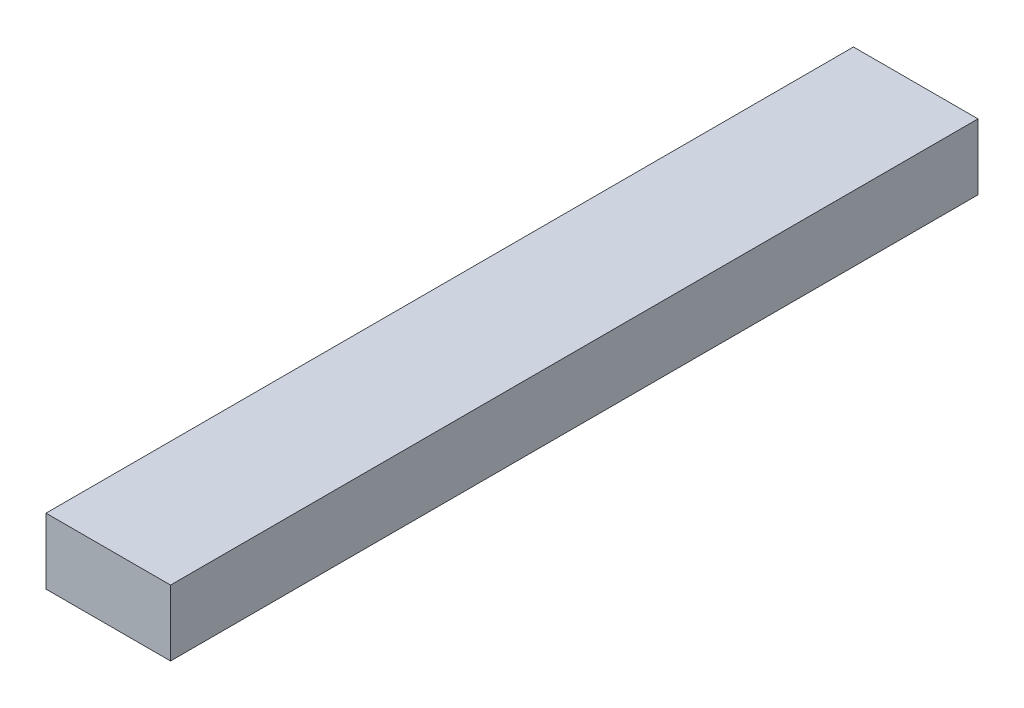
ISO-10303-21;
HEADER;
FILE_DESCRIPTION(('STEP AP214'),'2;1');
FILE_NAME('part.step','',(''),(''),'','','');
FILE_SCHEMA(('AUTOMOTIVE_DESIGN { 1 0 10303 214 1 1 1 1 }'));
ENDSEC;
DATA;
#1=APPLICATION_CONTEXT('core data for automotive mechanical design processes');
#2=APPLICATION_PROTOCOL_DEFINITION('international standard','automotive_design',2000,#1);
#3=PRODUCT_CONTEXT('',#1,'mechanical');
#4=PRODUCT('Part','Part','',(#3));
#5=PRODUCT_RELATED_PRODUCT_CATEGORY('part','',(#4));
#6=PRODUCT_DEFINITION_FORMATION('','',#4);
#7=PRODUCT_DEFINITION_CONTEXT('part definition',#1,'design');
#8=PRODUCT_DEFINITION('design','',#6,#7);
#9=PRODUCT_DEFINITION_SHAPE('','',#8);
#10=(LENGTH_UNIT() NAMED_UNIT(*) SI_UNIT(.MILLI.,.METRE.));
#11=(NAMED_UNIT(*) PLANE_ANGLE_UNIT() SI_UNIT($,.RADIAN.));
#12=(NAMED_UNIT(*) SI_UNIT($,.STERADIAN.) SOLID_ANGLE_UNIT());
#13=UNCERTAINTY_MEASURE_WITH_UNIT(LENGTH_MEASURE(1.E-05),#10,'distance_accuracy_value','');
#14=(GEOMETRIC_REPRESENTATION_CONTEXT(3) GLOBAL_UNCERTAINTY_ASSIGNED_CONTEXT((#13)) GLOBAL_UNIT_ASSIGNED_CONTEXT((#10,
#11,#12)) REPRESENTATION_CONTEXT('',''));
#15=CARTESIAN_POINT('',(0.,0.,0.));
#16=DIRECTION('',(0.,0.,1.));
#17=DIRECTION('',(1.,0.,0.));
#18=AXIS2_PLACEMENT_3D('',#15,#16,#17);
#19=CARTESIAN_POINT('',(0.,10.414,0.));
#20=DIRECTION('',(1.,0.,0.));
#21=DIRECTION('',(0.,0.,-1.));
#22=AXIS2_PLACEMENT_3D('',#19,#20,#21);
#23=PLANE('',#22);
#24=DIRECTION('',(0.,0.,1.));
#25=VECTOR('',#24,1.);
#26=CARTESIAN_POINT('',(0.,0.,0.));
#27=LINE('',#26,#25);
#28=CARTESIAN_POINT('',(0.,0.,-127.79375));
#29=VERTEX_POINT('',#28);
#30=CARTESIAN_POINT('',(0.,0.,0.));
#31=VERTEX_POINT('',#30);
#32=EDGE_CURVE('E101',#29,#31,#27,.T.);
#33=ORIENTED_EDGE('',*,*,#32,.T.);
#34=DIRECTION('',(0.,-1.,0.));
#35=VECTOR('',#34,1.);
#36=CARTESIAN_POINT('',(0.,10.414,0.));
#37=LINE('',#36,#35);
#38=CARTESIAN_POINT('',(0.,10.414,0.));
#39=VERTEX_POINT('',#38);
#40=EDGE_CURVE('E11',#39,#31,#37,.T.);
#41=ORIENTED_EDGE('',*,*,#40,.F.);
#42=DIRECTION('',(0.,0.,1.));
#43=VECTOR('',#42,1.);
#44=CARTESIAN_POINT('',(0.,10.414,0.));
#45=LINE('',#44,#43);
#46=CARTESIAN_POINT('',(0.,10.414,-127.79375));
#47=VERTEX_POINT('',#46);
#48=EDGE_CURVE('E89',#47,#39,#45,.T.);
#49=ORIENTED_EDGE('',*,*,#48,.F.);
#50=DIRECTION('',(0.,-1.,0.));
#51=VECTOR('',#50,1.);
#52=CARTESIAN_POINT('',(0.,10.414,-127.79375));
#53=LINE('',#52,#51);
#54=EDGE_CURVE('E97',#47,#29,#53,.T.);
#55=ORIENTED_EDGE('',*,*,#54,.T.);
#56=EDGE_LOOP('',(#33,#41,#49,#55));
#57=FACE_BOUND('',#56,.T.);
#58=ADVANCED_FACE('F38',(#57),#23,.F.);
#59=CARTESIAN_POINT('',(0.,10.414,0.));
#60=DIRECTION('',(0.,0.,-1.));
#61=DIRECTION('',(-1.,0.,0.));
#62=AXIS2_PLACEMENT_3D('',#59,#60,#61);
#63=PLANE('',#62);
#64=DIRECTION('',(1.,0.,0.));
#65=VECTOR('',#64,1.);
#66=CARTESIAN_POINT('',(0.,0.,0.));
#67=LINE('',#66,#65);
#68=CARTESIAN_POINT('',(19.7104,0.,0.));
#69=VERTEX_POINT('',#68);
#70=EDGE_CURVE('E93',#31,#69,#67,.T.);
#71=ORIENTED_EDGE('',*,*,#70,.T.);
#72=DIRECTION('',(0.,-1.,0.));
#73=VECTOR('',#72,1.);
#74=CARTESIAN_POINT('',(19.7104,10.414,0.));
#75=LINE('',#74,#73);
#76=CARTESIAN_POINT('',(19.7104,10.414,0.));
#77=VERTEX_POINT('',#76);
#78=EDGE_CURVE('E46',#77,#69,#75,.T.);
#79=ORIENTED_EDGE('',*,*,#78,.F.);
#80=DIRECTION('',(1.,0.,0.));
#81=VECTOR('',#80,1.);
#82=CARTESIAN_POINT('',(0.,10.414,0.));
#83=LINE('',#82,#81);
#84=EDGE_CURVE('E84',#39,#77,#83,.T.);
#85=ORIENTED_EDGE('',*,*,#84,.F.);
#86=ORIENTED_EDGE('',*,*,#40,.T.);
#87=EDGE_LOOP('',(#71,#79,#85,#86));
#88=FACE_BOUND('',#87,.T.);
#89=ADVANCED_FACE('F92',(#88),#63,.F.);
#90=CARTESIAN_POINT('',(19.7104,10.414,0.));
#91=DIRECTION('',(-1.,0.,0.));
#92=DIRECTION('',(0.,0.,1.));
#93=AXIS2_PLACEMENT_3D('',#90,#91,#92);
#94=PLANE('',#93);
#95=DIRECTION('',(0.,0.,-1.));
#96=VECTOR('',#95,1.);
#97=CARTESIAN_POINT('',(19.7104,0.,0.));
#98=LINE('',#97,#96);
#99=CARTESIAN_POINT('',(19.7104,0.,-127.79375));
#100=VERTEX_POINT('',#99);
#101=EDGE_CURVE('E71',#69,#100,#98,.T.);
#102=ORIENTED_EDGE('',*,*,#101,.T.);
#103=DIRECTION('',(0.,-1.,0.));
#104=VECTOR('',#103,1.);
#105=CARTESIAN_POINT('',(19.7104,10.414,-127.79375));
#106=LINE('',#105,#104);
#107=CARTESIAN_POINT('',(19.7104,10.414,-127.79375));
#108=VERTEX_POINT('',#107);
#109=EDGE_CURVE('E94',#108,#100,#106,.T.);
#110=ORIENTED_EDGE('',*,*,#109,.F.);
#111=DIRECTION('',(0.,0.,-1.));
#112=VECTOR('',#111,1.);
#113=CARTESIAN_POINT('',(19.7104,10.414,0.));
#114=LINE('',#113,#112);
#115=EDGE_CURVE('E87',#77,#108,#114,.T.);
#116=ORIENTED_EDGE('',*,*,#115,.F.);
#117=ORIENTED_EDGE('',*,*,#78,.T.);
#118=EDGE_LOOP('',(#102,#110,#116,#117));
#119=FACE_BOUND('',#118,.T.);
#120=ADVANCED_FACE('F95',(#119),#94,.F.);
#121=CARTESIAN_POINT('',(0.,10.414,-127.79375));
#122=DIRECTION('',(0.,0.,1.));
#123=DIRECTION('',(1.,0.,0.));
#124=AXIS2_PLACEMENT_3D('',#121,#122,#123);
#125=PLANE('',#124);
#126=DIRECTION('',(-1.,0.,0.));
#127=VECTOR('',#126,1.);
#128=CARTESIAN_POINT('',(0.,0.,-127.79375));
#129=LINE('',#128,#127);
#130=EDGE_CURVE('E77',#100,#29,#129,.T.);
#131=ORIENTED_EDGE('',*,*,#130,.T.);
#132=ORIENTED_EDGE('',*,*,#54,.F.);
#133=DIRECTION('',(-1.,0.,0.));
#134=VECTOR('',#133,1.);
#135=CARTESIAN_POINT('',(0.,10.414,-127.79375));
#136=LINE('',#135,#134);
#137=EDGE_CURVE('E54',#108,#47,#136,.T.);
#138=ORIENTED_EDGE('',*,*,#137,.F.);
#139=ORIENTED_EDGE('',*,*,#109,.T.);
#140=EDGE_LOOP('',(#131,#132,#138,#139));
#141=FACE_BOUND('',#140,.T.);
#142=ADVANCED_FACE('F108',(#141),#125,.F.);
#143=CARTESIAN_POINT('',(0.,10.414,0.));
#144=DIRECTION('',(0.,-1.,0.));
#145=DIRECTION('',(0.,0.,-1.));
#146=AXIS2_PLACEMENT_3D('',#143,#144,#145);
#147=PLANE('',#146);
#148=ORIENTED_EDGE('',*,*,#48,.T.);
#149=ORIENTED_EDGE('',*,*,#84,.T.);
#150=ORIENTED_EDGE('',*,*,#115,.T.);
#151=ORIENTED_EDGE('',*,*,#137,.T.);
#152=EDGE_LOOP('',(#148,#149,#150,#151));
#153=FACE_BOUND('',#152,.T.);
#154=ADVANCED_FACE('F85',(#153),#147,.F.);
#155=CARTESIAN_POINT('',(0.,0.,0.));
#156=DIRECTION('',(0.,-1.,0.));
#157=DIRECTION('',(0.,0.,-1.));
#158=AXIS2_PLACEMENT_3D('',#155,#156,#157);
#159=PLANE('',#158);
#160=ORIENTED_EDGE('',*,*,#32,.F.);
#161=ORIENTED_EDGE('',*,*,#130,.F.);
#162=ORIENTED_EDGE('',*,*,#101,.F.);
#163=ORIENTED_EDGE('',*,*,#70,.F.);
#164=EDGE_LOOP('',(#160,#161,#162,#163));
#165=FACE_BOUND('',#164,.T.);
#166=ADVANCED_FACE('F111',(#165),#159,.T.);
#167=CLOSED_SHELL('',(#58,#89,#120,#142,#154,#166));
#168=MANIFOLD_SOLID_BREP('B2',#167);
#169=ADVANCED_BREP_SHAPE_REPRESENTATION('',(#18,#168),#14);
#170=SHAPE_DEFINITION_REPRESENTATION(#9,#169);
ENDSEC;
END-ISO-10303-21;
